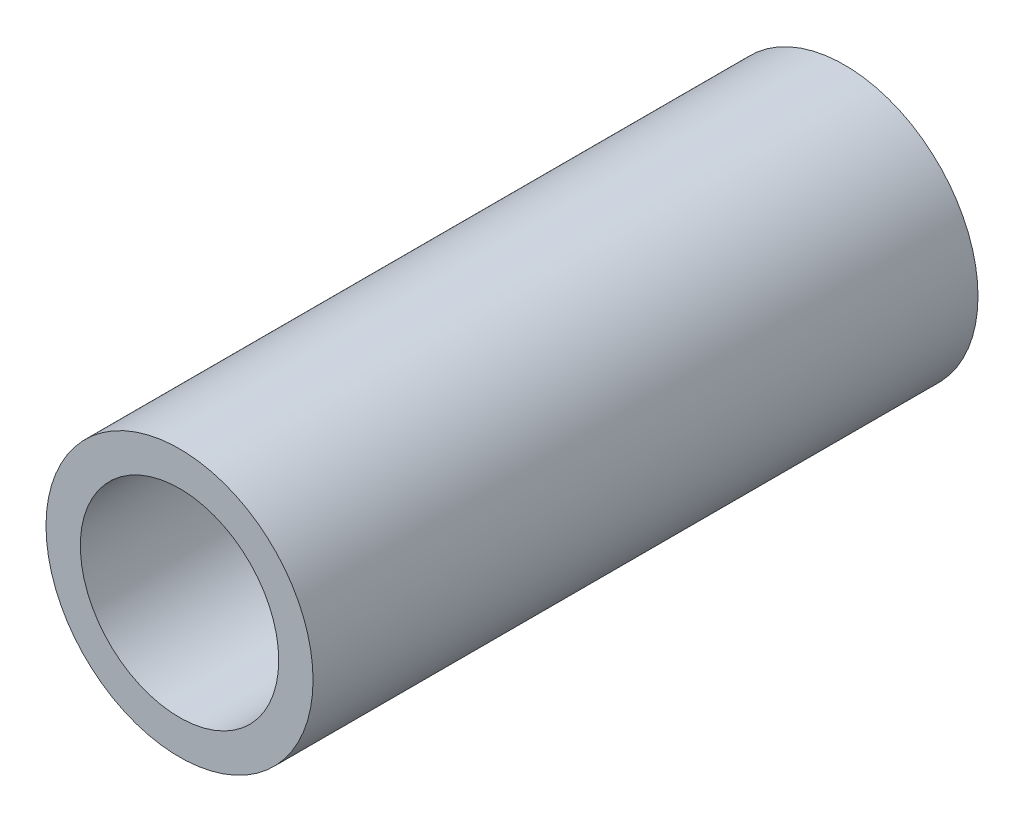
ISO-10303-21;
HEADER;
FILE_DESCRIPTION(('STEP AP214'),'2;1');
FILE_NAME('part.step','',(''),(''),'','','');
FILE_SCHEMA(('AUTOMOTIVE_DESIGN { 1 0 10303 214 1 1 1 1 }'));
ENDSEC;
DATA;
#1=APPLICATION_CONTEXT('core data for automotive mechanical design processes');
#2=APPLICATION_PROTOCOL_DEFINITION('international standard','automotive_design',2000,#1);
#3=PRODUCT_CONTEXT('',#1,'mechanical');
#4=PRODUCT('Part','Part','',(#3));
#5=PRODUCT_RELATED_PRODUCT_CATEGORY('part','',(#4));
#6=PRODUCT_DEFINITION_FORMATION('','',#4);
#7=PRODUCT_DEFINITION_CONTEXT('part definition',#1,'design');
#8=PRODUCT_DEFINITION('design','',#6,#7);
#9=PRODUCT_DEFINITION_SHAPE('','',#8);
#10=(LENGTH_UNIT() NAMED_UNIT(*) SI_UNIT(.MILLI.,.METRE.));
#11=(NAMED_UNIT(*) PLANE_ANGLE_UNIT() SI_UNIT($,.RADIAN.));
#12=(NAMED_UNIT(*) SI_UNIT($,.STERADIAN.) SOLID_ANGLE_UNIT());
#13=UNCERTAINTY_MEASURE_WITH_UNIT(LENGTH_MEASURE(1.E-05),#10,'distance_accuracy_value','');
#14=(GEOMETRIC_REPRESENTATION_CONTEXT(3) GLOBAL_UNCERTAINTY_ASSIGNED_CONTEXT((#13)) GLOBAL_UNIT_ASSIGNED_CONTEXT((#10,
#11,#12)) REPRESENTATION_CONTEXT('',''));
#15=CARTESIAN_POINT('',(0.,0.,0.));
#16=DIRECTION('',(0.,0.,1.));
#17=DIRECTION('',(1.,0.,0.));
#18=AXIS2_PLACEMENT_3D('',#15,#16,#17);
#19=CARTESIAN_POINT('',(0.,0.,7.9375));
#20=DIRECTION('',(0.,0.,1.));
#21=DIRECTION('',(1.,0.,0.));
#22=AXIS2_PLACEMENT_3D('',#19,#20,#21);
#23=PLANE('',#22);
#24=CARTESIAN_POINT('',(0.,0.,7.9375));
#25=DIRECTION('',(0.,0.,1.));
#26=DIRECTION('',(1.,0.,0.));
#27=AXIS2_PLACEMENT_3D('',#24,#25,#26);
#28=CIRCLE('',#27,3.1877);
#29=CARTESIAN_POINT('',(3.1877,0.,7.9375));
#30=VERTEX_POINT('',#29);
#31=EDGE_CURVE('E10',#30,#30,#28,.T.);
#32=ORIENTED_EDGE('',*,*,#31,.T.);
#33=EDGE_LOOP('',(#32));
#34=FACE_BOUND('',#33,.T.);
#35=CARTESIAN_POINT('',(0.,0.,7.9375));
#36=DIRECTION('',(0.,0.,1.));
#37=DIRECTION('',(1.,0.,0.));
#38=AXIS2_PLACEMENT_3D('',#35,#36,#37);
#39=CIRCLE('',#38,2.36855);
#40=CARTESIAN_POINT('',(2.36855,0.,7.9375));
#41=VERTEX_POINT('',#40);
#42=EDGE_CURVE('E43',#41,#41,#39,.T.);
#43=ORIENTED_EDGE('',*,*,#42,.F.);
#44=EDGE_LOOP('',(#43));
#45=FACE_BOUND('',#44,.T.);
#46=ADVANCED_FACE('F32',(#34,#45),#23,.T.);
#47=CARTESIAN_POINT('',(0.,0.,-7.9375));
#48=DIRECTION('',(0.,0.,1.));
#49=DIRECTION('',(1.,0.,0.));
#50=AXIS2_PLACEMENT_3D('',#47,#48,#49);
#51=PLANE('',#50);
#52=CARTESIAN_POINT('',(0.,0.,-7.9375));
#53=DIRECTION('',(0.,0.,1.));
#54=DIRECTION('',(1.,0.,0.));
#55=AXIS2_PLACEMENT_3D('',#52,#53,#54);
#56=CIRCLE('',#55,3.1877);
#57=CARTESIAN_POINT('',(3.1877,0.,-7.9375));
#58=VERTEX_POINT('',#57);
#59=EDGE_CURVE('E36',#58,#58,#56,.T.);
#60=ORIENTED_EDGE('',*,*,#59,.F.);
#61=EDGE_LOOP('',(#60));
#62=FACE_BOUND('',#61,.T.);
#63=CARTESIAN_POINT('',(0.,0.,-7.9375));
#64=DIRECTION('',(0.,0.,1.));
#65=DIRECTION('',(1.,0.,0.));
#66=AXIS2_PLACEMENT_3D('',#63,#64,#65);
#67=CIRCLE('',#66,2.36855);
#68=CARTESIAN_POINT('',(2.36855,0.,-7.9375));
#69=VERTEX_POINT('',#68);
#70=EDGE_CURVE('E45',#69,#69,#67,.T.);
#71=ORIENTED_EDGE('',*,*,#70,.T.);
#72=EDGE_LOOP('',(#71));
#73=FACE_BOUND('',#72,.T.);
#74=ADVANCED_FACE('F55',(#62,#73),#51,.F.);
#75=CARTESIAN_POINT('',(0.,0.,7.9375));
#76=DIRECTION('',(0.,0.,-1.));
#77=DIRECTION('',(-1.,0.,0.));
#78=AXIS2_PLACEMENT_3D('',#75,#76,#77);
#79=CYLINDRICAL_SURFACE('',#78,3.1877);
#80=ORIENTED_EDGE('',*,*,#31,.F.);
#81=EDGE_LOOP('',(#80));
#82=FACE_BOUND('',#81,.T.);
#83=ORIENTED_EDGE('',*,*,#59,.T.);
#84=EDGE_LOOP('',(#83));
#85=FACE_BOUND('',#84,.T.);
#86=ADVANCED_FACE('F34',(#82,#85),#79,.T.);
#87=CARTESIAN_POINT('',(0.,0.,7.9375));
#88=DIRECTION('',(0.,0.,-1.));
#89=DIRECTION('',(-1.,0.,0.));
#90=AXIS2_PLACEMENT_3D('',#87,#88,#89);
#91=CYLINDRICAL_SURFACE('',#90,2.36855);
#92=ORIENTED_EDGE('',*,*,#42,.T.);
#93=EDGE_LOOP('',(#92));
#94=FACE_BOUND('',#93,.T.);
#95=ORIENTED_EDGE('',*,*,#70,.F.);
#96=EDGE_LOOP('',(#95));
#97=FACE_BOUND('',#96,.T.);
#98=ADVANCED_FACE('F51',(#94,#97),#91,.F.);
#99=CLOSED_SHELL('',(#46,#74,#86,#98));
#100=MANIFOLD_SOLID_BREP('B2',#99);
#101=ADVANCED_BREP_SHAPE_REPRESENTATION('',(#18,#100),#14);
#102=SHAPE_DEFINITION_REPRESENTATION(#9,#101);
ENDSEC;
END-ISO-10303-21;
